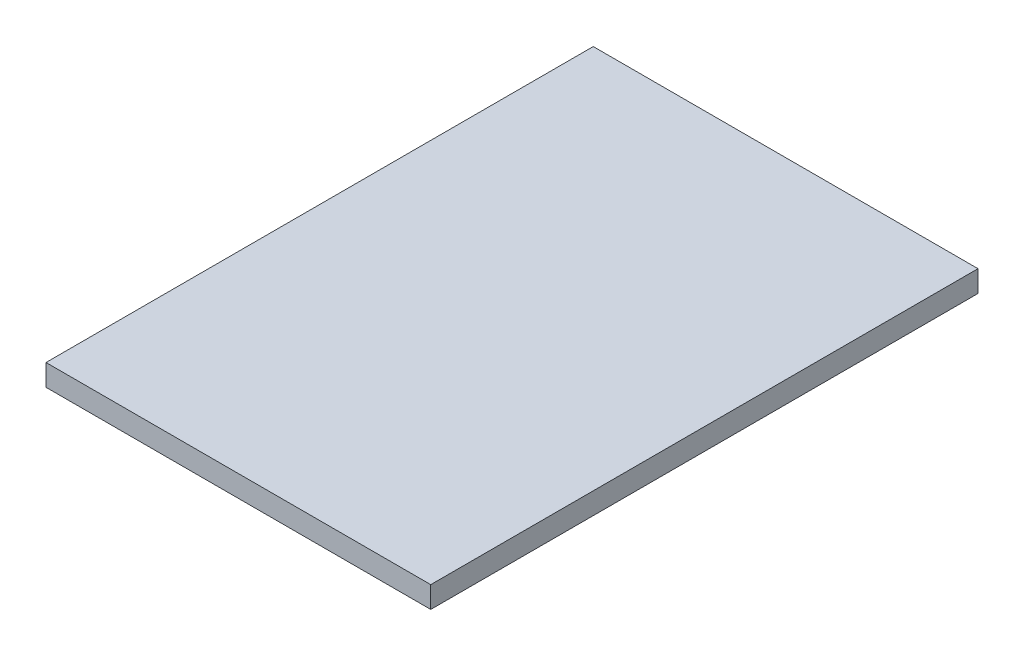
ISO-10303-21;
HEADER;
FILE_DESCRIPTION(('STEP AP214'),'2;1');
FILE_NAME('part.step','',(''),(''),'','','');
FILE_SCHEMA(('AUTOMOTIVE_DESIGN { 1 0 10303 214 1 1 1 1 }'));
ENDSEC;
DATA;
#1=APPLICATION_CONTEXT('core data for automotive mechanical design processes');
#2=APPLICATION_PROTOCOL_DEFINITION('international standard','automotive_design',2000,#1);
#3=PRODUCT_CONTEXT('',#1,'mechanical');
#4=PRODUCT('Part','Part','',(#3));
#5=PRODUCT_RELATED_PRODUCT_CATEGORY('part','',(#4));
#6=PRODUCT_DEFINITION_FORMATION('','',#4);
#7=PRODUCT_DEFINITION_CONTEXT('part definition',#1,'design');
#8=PRODUCT_DEFINITION('design','',#6,#7);
#9=PRODUCT_DEFINITION_SHAPE('','',#8);
#10=(LENGTH_UNIT() NAMED_UNIT(*) SI_UNIT(.MILLI.,.METRE.));
#11=(NAMED_UNIT(*) PLANE_ANGLE_UNIT() SI_UNIT($,.RADIAN.));
#12=(NAMED_UNIT(*) SI_UNIT($,.STERADIAN.) SOLID_ANGLE_UNIT());
#13=UNCERTAINTY_MEASURE_WITH_UNIT(LENGTH_MEASURE(1.E-05),#10,'distance_accuracy_value','');
#14=(GEOMETRIC_REPRESENTATION_CONTEXT(3) GLOBAL_UNCERTAINTY_ASSIGNED_CONTEXT((#13)) GLOBAL_UNIT_ASSIGNED_CONTEXT((#10,
#11,#12)) REPRESENTATION_CONTEXT('',''));
#15=CARTESIAN_POINT('',(0.,0.,0.));
#16=DIRECTION('',(0.,0.,1.));
#17=DIRECTION('',(1.,0.,0.));
#18=AXIS2_PLACEMENT_3D('',#15,#16,#17);
#19=CARTESIAN_POINT('',(80.5,9.,114.5));
#20=DIRECTION('',(-1.,0.,0.));
#21=DIRECTION('',(0.,0.,1.));
#22=AXIS2_PLACEMENT_3D('',#19,#20,#21);
#23=PLANE('',#22);
#24=DIRECTION('',(0.,0.,-1.));
#25=VECTOR('',#24,1.);
#26=CARTESIAN_POINT('',(80.5,0.,114.5));
#27=LINE('',#26,#25);
#28=CARTESIAN_POINT('',(80.5,0.,114.5));
#29=VERTEX_POINT('',#28);
#30=CARTESIAN_POINT('',(80.5,0.,-114.5));
#31=VERTEX_POINT('',#30);
#32=EDGE_CURVE('E100',#29,#31,#27,.T.);
#33=ORIENTED_EDGE('',*,*,#32,.T.);
#34=DIRECTION('',(0.,-1.,0.));
#35=VECTOR('',#34,1.);
#36=CARTESIAN_POINT('',(80.5,9.,-114.5));
#37=LINE('',#36,#35);
#38=CARTESIAN_POINT('',(80.5,9.,-114.5));
#39=VERTEX_POINT('',#38);
#40=EDGE_CURVE('E11',#39,#31,#37,.T.);
#41=ORIENTED_EDGE('',*,*,#40,.F.);
#42=DIRECTION('',(0.,0.,-1.));
#43=VECTOR('',#42,1.);
#44=CARTESIAN_POINT('',(80.5,9.,114.5));
#45=LINE('',#44,#43);
#46=CARTESIAN_POINT('',(80.5,9.,114.5));
#47=VERTEX_POINT('',#46);
#48=EDGE_CURVE('E88',#47,#39,#45,.T.);
#49=ORIENTED_EDGE('',*,*,#48,.F.);
#50=DIRECTION('',(0.,-1.,0.));
#51=VECTOR('',#50,1.);
#52=CARTESIAN_POINT('',(80.5,9.,114.5));
#53=LINE('',#52,#51);
#54=EDGE_CURVE('E96',#47,#29,#53,.T.);
#55=ORIENTED_EDGE('',*,*,#54,.T.);
#56=EDGE_LOOP('',(#33,#41,#49,#55));
#57=FACE_BOUND('',#56,.T.);
#58=ADVANCED_FACE('F37',(#57),#23,.F.);
#59=CARTESIAN_POINT('',(-80.5,9.,-114.5));
#60=DIRECTION('',(0.,0.,1.));
#61=DIRECTION('',(1.,0.,0.));
#62=AXIS2_PLACEMENT_3D('',#59,#60,#61);
#63=PLANE('',#62);
#64=DIRECTION('',(-1.,0.,0.));
#65=VECTOR('',#64,1.);
#66=CARTESIAN_POINT('',(-80.5,0.,-114.5));
#67=LINE('',#66,#65);
#68=CARTESIAN_POINT('',(-80.5,0.,-114.5));
#69=VERTEX_POINT('',#68);
#70=EDGE_CURVE('E92',#31,#69,#67,.T.);
#71=ORIENTED_EDGE('',*,*,#70,.T.);
#72=DIRECTION('',(0.,-1.,0.));
#73=VECTOR('',#72,1.);
#74=CARTESIAN_POINT('',(-80.5,9.,-114.5));
#75=LINE('',#74,#73);
#76=CARTESIAN_POINT('',(-80.5,9.,-114.5));
#77=VERTEX_POINT('',#76);
#78=EDGE_CURVE('E45',#77,#69,#75,.T.);
#79=ORIENTED_EDGE('',*,*,#78,.F.);
#80=DIRECTION('',(-1.,0.,0.));
#81=VECTOR('',#80,1.);
#82=CARTESIAN_POINT('',(-80.5,9.,-114.5));
#83=LINE('',#82,#81);
#84=EDGE_CURVE('E83',#39,#77,#83,.T.);
#85=ORIENTED_EDGE('',*,*,#84,.F.);
#86=ORIENTED_EDGE('',*,*,#40,.T.);
#87=EDGE_LOOP('',(#71,#79,#85,#86));
#88=FACE_BOUND('',#87,.T.);
#89=ADVANCED_FACE('F91',(#88),#63,.F.);
#90=CARTESIAN_POINT('',(-80.5,9.,114.5));
#91=DIRECTION('',(1.,0.,0.));
#92=DIRECTION('',(0.,0.,-1.));
#93=AXIS2_PLACEMENT_3D('',#90,#91,#92);
#94=PLANE('',#93);
#95=DIRECTION('',(0.,0.,1.));
#96=VECTOR('',#95,1.);
#97=CARTESIAN_POINT('',(-80.5,0.,114.5));
#98=LINE('',#97,#96);
#99=CARTESIAN_POINT('',(-80.5,0.,114.5));
#100=VERTEX_POINT('',#99);
#101=EDGE_CURVE('E70',#69,#100,#98,.T.);
#102=ORIENTED_EDGE('',*,*,#101,.T.);
#103=DIRECTION('',(0.,-1.,0.));
#104=VECTOR('',#103,1.);
#105=CARTESIAN_POINT('',(-80.5,9.,114.5));
#106=LINE('',#105,#104);
#107=CARTESIAN_POINT('',(-80.5,9.,114.5));
#108=VERTEX_POINT('',#107);
#109=EDGE_CURVE('E93',#108,#100,#106,.T.);
#110=ORIENTED_EDGE('',*,*,#109,.F.);
#111=DIRECTION('',(0.,0.,1.));
#112=VECTOR('',#111,1.);
#113=CARTESIAN_POINT('',(-80.5,9.,114.5));
#114=LINE('',#113,#112);
#115=EDGE_CURVE('E86',#77,#108,#114,.T.);
#116=ORIENTED_EDGE('',*,*,#115,.F.);
#117=ORIENTED_EDGE('',*,*,#78,.T.);
#118=EDGE_LOOP('',(#102,#110,#116,#117));
#119=FACE_BOUND('',#118,.T.);
#120=ADVANCED_FACE('F94',(#119),#94,.F.);
#121=CARTESIAN_POINT('',(-80.5,9.,114.5));
#122=DIRECTION('',(0.,0.,-1.));
#123=DIRECTION('',(-1.,0.,0.));
#124=AXIS2_PLACEMENT_3D('',#121,#122,#123);
#125=PLANE('',#124);
#126=DIRECTION('',(1.,0.,0.));
#127=VECTOR('',#126,1.);
#128=CARTESIAN_POINT('',(-80.5,0.,114.5));
#129=LINE('',#128,#127);
#130=EDGE_CURVE('E76',#100,#29,#129,.T.);
#131=ORIENTED_EDGE('',*,*,#130,.T.);
#132=ORIENTED_EDGE('',*,*,#54,.F.);
#133=DIRECTION('',(1.,0.,0.));
#134=VECTOR('',#133,1.);
#135=CARTESIAN_POINT('',(-80.5,9.,114.5));
#136=LINE('',#135,#134);
#137=EDGE_CURVE('E53',#108,#47,#136,.T.);
#138=ORIENTED_EDGE('',*,*,#137,.F.);
#139=ORIENTED_EDGE('',*,*,#109,.T.);
#140=EDGE_LOOP('',(#131,#132,#138,#139));
#141=FACE_BOUND('',#140,.T.);
#142=ADVANCED_FACE('F107',(#141),#125,.F.);
#143=CARTESIAN_POINT('',(0.,9.,0.));
#144=DIRECTION('',(0.,-1.,0.));
#145=DIRECTION('',(0.,0.,-1.));
#146=AXIS2_PLACEMENT_3D('',#143,#144,#145);
#147=PLANE('',#146);
#148=ORIENTED_EDGE('',*,*,#48,.T.);
#149=ORIENTED_EDGE('',*,*,#84,.T.);
#150=ORIENTED_EDGE('',*,*,#115,.T.);
#151=ORIENTED_EDGE('',*,*,#137,.T.);
#152=EDGE_LOOP('',(#148,#149,#150,#151));
#153=FACE_BOUND('',#152,.T.);
#154=ADVANCED_FACE('F84',(#153),#147,.F.);
#155=CARTESIAN_POINT('',(0.,0.,0.));
#156=DIRECTION('',(0.,-1.,0.));
#157=DIRECTION('',(0.,0.,-1.));
#158=AXIS2_PLACEMENT_3D('',#155,#156,#157);
#159=PLANE('',#158);
#160=ORIENTED_EDGE('',*,*,#32,.F.);
#161=ORIENTED_EDGE('',*,*,#130,.F.);
#162=ORIENTED_EDGE('',*,*,#101,.F.);
#163=ORIENTED_EDGE('',*,*,#70,.F.);
#164=EDGE_LOOP('',(#160,#161,#162,#163));
#165=FACE_BOUND('',#164,.T.);
#166=ADVANCED_FACE('F110',(#165),#159,.T.);
#167=CLOSED_SHELL('',(#58,#89,#120,#142,#154,#166));
#168=MANIFOLD_SOLID_BREP('B2',#167);
#169=ADVANCED_BREP_SHAPE_REPRESENTATION('',(#18,#168),#14);
#170=SHAPE_DEFINITION_REPRESENTATION(#9,#169);
ENDSEC;
END-ISO-10303-21;
